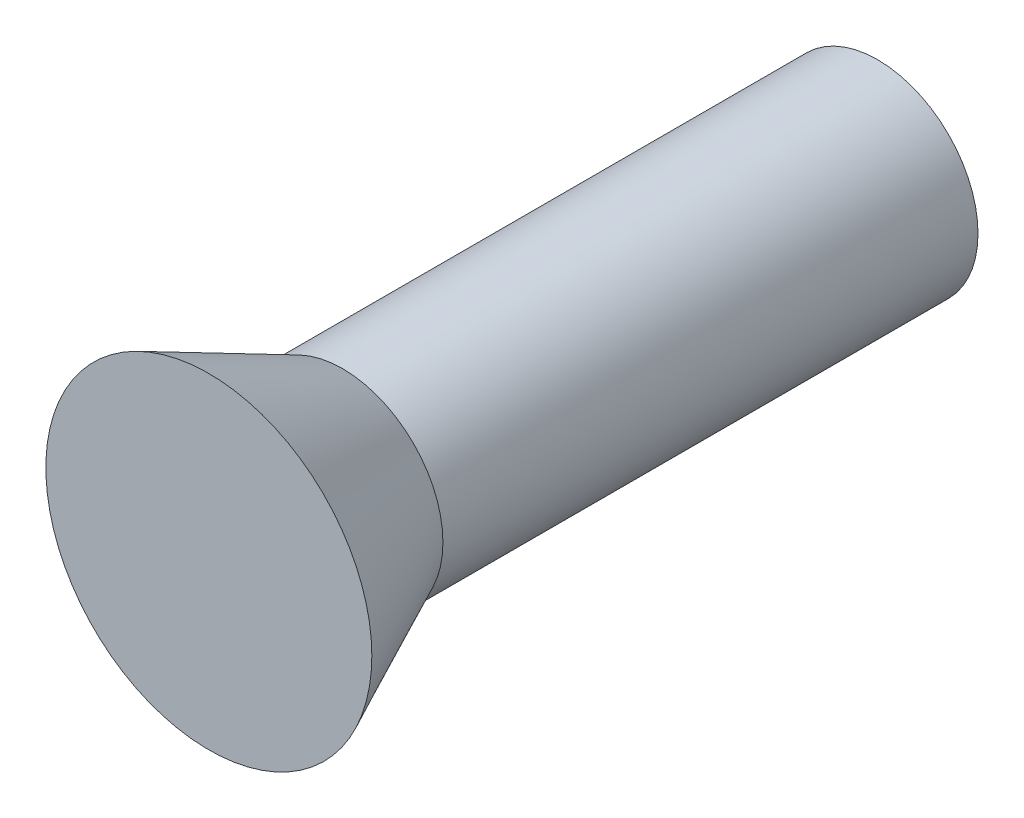
ISO-10303-21;
HEADER;
FILE_DESCRIPTION(('STEP AP214'),'2;1');
FILE_NAME('part.step','',(''),(''),'','','');
FILE_SCHEMA(('AUTOMOTIVE_DESIGN { 1 0 10303 214 1 1 1 1 }'));
ENDSEC;
DATA;
#1=APPLICATION_CONTEXT('core data for automotive mechanical design processes');
#2=APPLICATION_PROTOCOL_DEFINITION('international standard','automotive_design',2000,#1);
#3=PRODUCT_CONTEXT('',#1,'mechanical');
#4=PRODUCT('Part','Part','',(#3));
#5=PRODUCT_RELATED_PRODUCT_CATEGORY('part','',(#4));
#6=PRODUCT_DEFINITION_FORMATION('','',#4);
#7=PRODUCT_DEFINITION_CONTEXT('part definition',#1,'design');
#8=PRODUCT_DEFINITION('design','',#6,#7);
#9=PRODUCT_DEFINITION_SHAPE('','',#8);
#10=(LENGTH_UNIT() NAMED_UNIT(*) SI_UNIT(.MILLI.,.METRE.));
#11=(NAMED_UNIT(*) PLANE_ANGLE_UNIT() SI_UNIT($,.RADIAN.));
#12=(NAMED_UNIT(*) SI_UNIT($,.STERADIAN.) SOLID_ANGLE_UNIT());
#13=UNCERTAINTY_MEASURE_WITH_UNIT(LENGTH_MEASURE(1.E-05),#10,'distance_accuracy_value','');
#14=(GEOMETRIC_REPRESENTATION_CONTEXT(3) GLOBAL_UNCERTAINTY_ASSIGNED_CONTEXT((#13)) GLOBAL_UNIT_ASSIGNED_CONTEXT((#10,
#11,#12)) REPRESENTATION_CONTEXT('',''));
#15=CARTESIAN_POINT('',(0.,0.,0.));
#16=DIRECTION('',(0.,0.,1.));
#17=DIRECTION('',(1.,0.,0.));
#18=AXIS2_PLACEMENT_3D('',#15,#16,#17);
#19=CARTESIAN_POINT('',(0.,0.,-10.));
#20=DIRECTION('',(0.,0.,-1.));
#21=DIRECTION('',(-1.,0.,0.));
#22=AXIS2_PLACEMENT_3D('',#19,#20,#21);
#23=PLANE('',#22);
#24=CARTESIAN_POINT('',(0.,0.,-10.));
#25=DIRECTION('',(0.,0.,1.));
#26=DIRECTION('',(1.,0.,0.));
#27=AXIS2_PLACEMENT_3D('',#24,#25,#26);
#28=CIRCLE('',#27,1.5);
#29=CARTESIAN_POINT('',(1.5,0.,-10.));
#30=VERTEX_POINT('',#29);
#31=EDGE_CURVE('E10',#30,#30,#28,.T.);
#32=ORIENTED_EDGE('',*,*,#31,.F.);
#33=EDGE_LOOP('',(#32));
#34=FACE_BOUND('',#33,.T.);
#35=ADVANCED_FACE('F32',(#34),#23,.T.);
#36=CARTESIAN_POINT('',(0.,0.,0.));
#37=DIRECTION('',(0.,0.,1.));
#38=DIRECTION('',(1.,0.,0.));
#39=AXIS2_PLACEMENT_3D('',#36,#37,#38);
#40=CYLINDRICAL_SURFACE('',#39,1.5);
#41=ORIENTED_EDGE('',*,*,#31,.T.);
#42=EDGE_LOOP('',(#41));
#43=FACE_BOUND('',#42,.T.);
#44=CARTESIAN_POINT('',(0.,0.,-2.));
#45=DIRECTION('',(0.,0.,1.));
#46=DIRECTION('',(1.,0.,0.));
#47=AXIS2_PLACEMENT_3D('',#44,#45,#46);
#48=CIRCLE('',#47,1.5);
#49=CARTESIAN_POINT('',(1.5,0.,-2.));
#50=VERTEX_POINT('',#49);
#51=EDGE_CURVE('E38',#50,#50,#48,.T.);
#52=ORIENTED_EDGE('',*,*,#51,.F.);
#53=EDGE_LOOP('',(#52));
#54=FACE_BOUND('',#53,.T.);
#55=ADVANCED_FACE('F53',(#43,#54),#40,.T.);
#56=CARTESIAN_POINT('',(0.,0.,0.));
#57=DIRECTION('',(0.,0.,1.));
#58=DIRECTION('',(1.,0.,0.));
#59=AXIS2_PLACEMENT_3D('',#56,#57,#58);
#60=CONICAL_SURFACE('',#59,2.43708345163901,0.438165791378573);
#61=ORIENTED_EDGE('',*,*,#51,.T.);
#62=EDGE_LOOP('',(#61));
#63=FACE_BOUND('',#62,.T.);
#64=CARTESIAN_POINT('',(0.,0.,0.));
#65=DIRECTION('',(0.,0.,1.));
#66=DIRECTION('',(1.,0.,0.));
#67=AXIS2_PLACEMENT_3D('',#64,#65,#66);
#68=CIRCLE('',#67,2.43708345163901);
#69=CARTESIAN_POINT('',(2.43708345163901,0.,0.));
#70=VERTEX_POINT('',#69);
#71=EDGE_CURVE('E42',#70,#70,#68,.T.);
#72=ORIENTED_EDGE('',*,*,#71,.F.);
#73=EDGE_LOOP('',(#72));
#74=FACE_BOUND('',#73,.T.);
#75=ADVANCED_FACE('F51',(#63,#74),#60,.T.);
#76=CARTESIAN_POINT('',(2.43708345163901,0.,0.));
#77=DIRECTION('',(0.,0.,1.));
#78=DIRECTION('',(1.,0.,0.));
#79=AXIS2_PLACEMENT_3D('',#76,#77,#78);
#80=PLANE('',#79);
#81=ORIENTED_EDGE('',*,*,#71,.T.);
#82=EDGE_LOOP('',(#81));
#83=FACE_BOUND('',#82,.T.);
#84=ADVANCED_FACE('F49',(#83),#80,.T.);
#85=CLOSED_SHELL('',(#35,#55,#75,#84));
#86=MANIFOLD_SOLID_BREP('B2',#85);
#87=ADVANCED_BREP_SHAPE_REPRESENTATION('',(#18,#86),#14);
#88=SHAPE_DEFINITION_REPRESENTATION(#9,#87);
ENDSEC;
END-ISO-10303-21;
